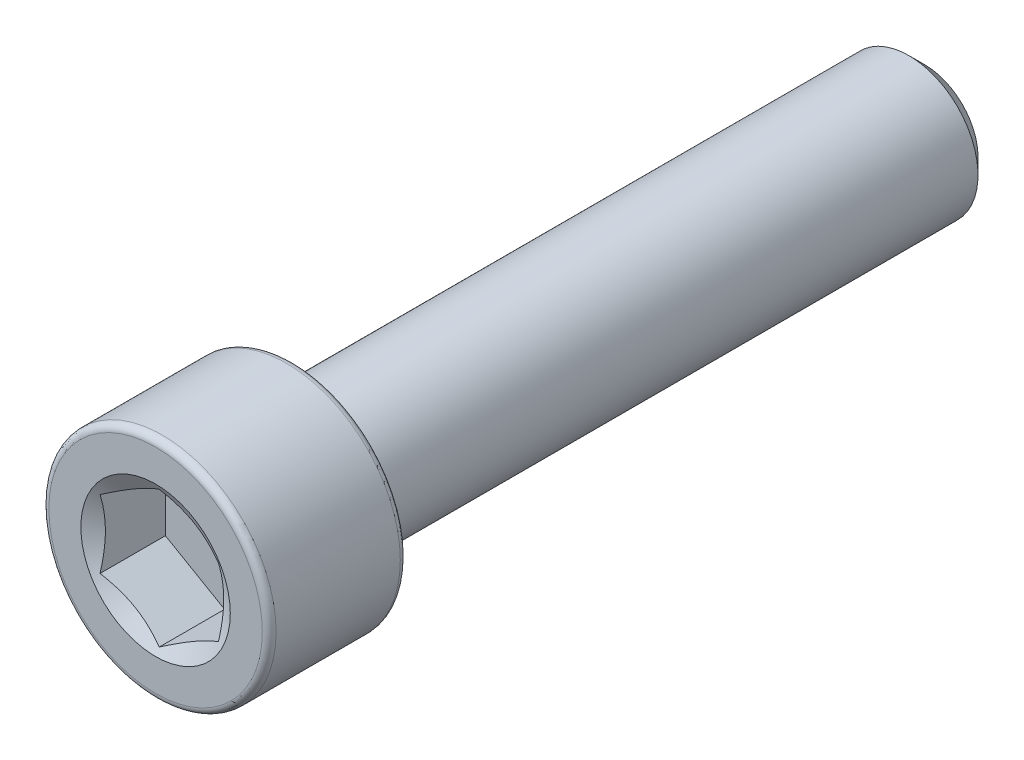
ISO-10303-21;
HEADER;
FILE_DESCRIPTION(('STEP AP214'),'2;1');
FILE_NAME('part.step','',(''),(''),'','','');
FILE_SCHEMA(('AUTOMOTIVE_DESIGN { 1 0 10303 214 1 1 1 1 }'));
ENDSEC;
DATA;
#1=APPLICATION_CONTEXT('core data for automotive mechanical design processes');
#2=APPLICATION_PROTOCOL_DEFINITION('international standard','automotive_design',2000,#1);
#3=PRODUCT_CONTEXT('',#1,'mechanical');
#4=PRODUCT('Part','Part','',(#3));
#5=PRODUCT_RELATED_PRODUCT_CATEGORY('part','',(#4));
#6=PRODUCT_DEFINITION_FORMATION('','',#4);
#7=PRODUCT_DEFINITION_CONTEXT('part definition',#1,'design');
#8=PRODUCT_DEFINITION('design','',#6,#7);
#9=PRODUCT_DEFINITION_SHAPE('','',#8);
#10=(LENGTH_UNIT() NAMED_UNIT(*) SI_UNIT(.MILLI.,.METRE.));
#11=(NAMED_UNIT(*) PLANE_ANGLE_UNIT() SI_UNIT($,.RADIAN.));
#12=(NAMED_UNIT(*) SI_UNIT($,.STERADIAN.) SOLID_ANGLE_UNIT());
#13=UNCERTAINTY_MEASURE_WITH_UNIT(LENGTH_MEASURE(1.E-05),#10,'distance_accuracy_value','');
#14=(GEOMETRIC_REPRESENTATION_CONTEXT(3) GLOBAL_UNCERTAINTY_ASSIGNED_CONTEXT((#13)) GLOBAL_UNIT_ASSIGNED_CONTEXT((#10,
#11,#12)) REPRESENTATION_CONTEXT('',''));
#15=CARTESIAN_POINT('',(0.,0.,0.));
#16=DIRECTION('',(0.,0.,1.));
#17=DIRECTION('',(1.,0.,0.));
#18=AXIS2_PLACEMENT_3D('',#15,#16,#17);
#19=CARTESIAN_POINT('',(0.,0.,-11.6078));
#20=DIRECTION('',(0.,0.,-1.));
#21=DIRECTION('',(-1.,0.,0.));
#22=AXIS2_PLACEMENT_3D('',#19,#20,#21);
#23=PLANE('',#22);
#24=CARTESIAN_POINT('',(0.,0.,-11.6078));
#25=DIRECTION('',(0.,0.,-1.));
#26=DIRECTION('',(-1.,0.,0.));
#27=AXIS2_PLACEMENT_3D('',#24,#25,#26);
#28=CIRCLE('',#27,1.60655000000001);
#29=CARTESIAN_POINT('',(-1.60655000000001,0.,-11.6078));
#30=VERTEX_POINT('',#29);
#31=EDGE_CURVE('E57',#30,#30,#28,.T.);
#32=ORIENTED_EDGE('',*,*,#31,.T.);
#33=EDGE_LOOP('',(#32));
#34=FACE_BOUND('',#33,.T.);
#35=ADVANCED_FACE('F43',(#34),#23,.T.);
#36=CARTESIAN_POINT('',(0.,0.,-11.6078));
#37=DIRECTION('',(0.,0.,1.));
#38=DIRECTION('',(1.,0.,0.));
#39=AXIS2_PLACEMENT_3D('',#36,#37,#38);
#40=CONICAL_SURFACE('',#39,1.60655000000001,0.785398163397449);
#41=CARTESIAN_POINT('',(0.,0.,-11.13155));
#42=DIRECTION('',(0.,0.,-1.));
#43=DIRECTION('',(-1.,0.,0.));
#44=AXIS2_PLACEMENT_3D('',#41,#42,#43);
#45=CIRCLE('',#44,2.08280000000001);
#46=CARTESIAN_POINT('',(-2.08280000000001,0.,-11.13155));
#47=VERTEX_POINT('',#46);
#48=EDGE_CURVE('E151',#47,#47,#45,.T.);
#49=ORIENTED_EDGE('',*,*,#48,.T.);
#50=EDGE_LOOP('',(#49));
#51=FACE_BOUND('',#50,.T.);
#52=ORIENTED_EDGE('',*,*,#31,.F.);
#53=EDGE_LOOP('',(#52));
#54=FACE_BOUND('',#53,.T.);
#55=ADVANCED_FACE('F159',(#51,#54),#40,.T.);
#56=CARTESIAN_POINT('',(0.,0.,-11.6078));
#57=DIRECTION('',(0.,0.,-1.));
#58=DIRECTION('',(-1.,0.,0.));
#59=AXIS2_PLACEMENT_3D('',#56,#57,#58);
#60=CYLINDRICAL_SURFACE('',#59,2.08280000000001);
#61=CARTESIAN_POINT('',(0.,0.,7.44220000000001));
#62=DIRECTION('',(0.,0.,-1.));
#63=DIRECTION('',(-1.,0.,0.));
#64=AXIS2_PLACEMENT_3D('',#61,#62,#63);
#65=CIRCLE('',#64,2.08280000000001);
#66=CARTESIAN_POINT('',(-2.08280000000001,0.,7.44220000000001));
#67=VERTEX_POINT('',#66);
#68=EDGE_CURVE('E147',#67,#67,#65,.T.);
#69=ORIENTED_EDGE('',*,*,#68,.T.);
#70=EDGE_LOOP('',(#69));
#71=FACE_BOUND('',#70,.T.);
#72=ORIENTED_EDGE('',*,*,#48,.F.);
#73=EDGE_LOOP('',(#72));
#74=FACE_BOUND('',#73,.T.);
#75=ADVANCED_FACE('F161',(#71,#74),#60,.T.);
#76=CARTESIAN_POINT('',(0.,2.0828,7.4422));
#77=DIRECTION('',(0.,0.,-1.));
#78=DIRECTION('',(-1.,0.,0.));
#79=AXIS2_PLACEMENT_3D('',#76,#77,#78);
#80=PLANE('',#79);
#81=CARTESIAN_POINT('',(0.,0.,7.44220000000001));
#82=DIRECTION('',(0.,0.,-1.));
#83=DIRECTION('',(-1.,0.,0.));
#84=AXIS2_PLACEMENT_3D('',#81,#82,#83);
#85=CIRCLE('',#84,3.22072);
#86=CARTESIAN_POINT('',(-3.22072,0.,7.44220000000001));
#87=VERTEX_POINT('',#86);
#88=EDGE_CURVE('E143',#87,#87,#85,.T.);
#89=ORIENTED_EDGE('',*,*,#88,.T.);
#90=EDGE_LOOP('',(#89));
#91=FACE_BOUND('',#90,.T.);
#92=ORIENTED_EDGE('',*,*,#68,.F.);
#93=EDGE_LOOP('',(#92));
#94=FACE_BOUND('',#93,.T.);
#95=ADVANCED_FACE('F168',(#91,#94),#80,.T.);
#96=CARTESIAN_POINT('',(0.,0.,7.65048));
#97=DIRECTION('',(0.,0.,-1.));
#98=DIRECTION('',(-1.,0.,0.));
#99=AXIS2_PLACEMENT_3D('',#96,#97,#98);
#100=TOROIDAL_SURFACE('',#99,3.22072,0.20828);
#101=CARTESIAN_POINT('',(0.,0.,7.65048000000001));
#102=DIRECTION('',(0.,0.,-1.));
#103=DIRECTION('',(-1.,0.,0.));
#104=AXIS2_PLACEMENT_3D('',#101,#102,#103);
#105=CIRCLE('',#104,3.429);
#106=CARTESIAN_POINT('',(-3.429,0.,7.65048000000001));
#107=VERTEX_POINT('',#106);
#108=EDGE_CURVE('E139',#107,#107,#105,.T.);
#109=ORIENTED_EDGE('',*,*,#108,.T.);
#110=EDGE_LOOP('',(#109));
#111=FACE_BOUND('',#110,.T.);
#112=ORIENTED_EDGE('',*,*,#88,.F.);
#113=EDGE_LOOP('',(#112));
#114=FACE_BOUND('',#113,.T.);
#115=ADVANCED_FACE('F174',(#111,#114),#100,.T.);
#116=CARTESIAN_POINT('',(0.,0.,-11.6078));
#117=DIRECTION('',(0.,0.,-1.));
#118=DIRECTION('',(-1.,0.,0.));
#119=AXIS2_PLACEMENT_3D('',#116,#117,#118);
#120=CYLINDRICAL_SURFACE('',#119,3.429);
#121=CARTESIAN_POINT('',(0.,0.,11.39952));
#122=DIRECTION('',(0.,0.,-1.));
#123=DIRECTION('',(-1.,0.,0.));
#124=AXIS2_PLACEMENT_3D('',#121,#122,#123);
#125=CIRCLE('',#124,3.429);
#126=CARTESIAN_POINT('',(-3.429,0.,11.39952));
#127=VERTEX_POINT('',#126);
#128=EDGE_CURVE('E135',#127,#127,#125,.T.);
#129=ORIENTED_EDGE('',*,*,#128,.T.);
#130=EDGE_LOOP('',(#129));
#131=FACE_BOUND('',#130,.T.);
#132=ORIENTED_EDGE('',*,*,#108,.F.);
#133=EDGE_LOOP('',(#132));
#134=FACE_BOUND('',#133,.T.);
#135=ADVANCED_FACE('F178',(#131,#134),#120,.T.);
#136=CARTESIAN_POINT('',(0.,0.,11.39952));
#137=DIRECTION('',(0.,0.,-1.));
#138=DIRECTION('',(-1.,0.,0.));
#139=AXIS2_PLACEMENT_3D('',#136,#137,#138);
#140=TOROIDAL_SURFACE('',#139,3.22072,0.208280000000001);
#141=CARTESIAN_POINT('',(0.,0.,11.6078));
#142=DIRECTION('',(0.,0.,-1.));
#143=DIRECTION('',(-1.,0.,0.));
#144=AXIS2_PLACEMENT_3D('',#141,#142,#143);
#145=CIRCLE('',#144,3.22072);
#146=CARTESIAN_POINT('',(-3.22072,0.,11.6078));
#147=VERTEX_POINT('',#146);
#148=EDGE_CURVE('E131',#147,#147,#145,.T.);
#149=ORIENTED_EDGE('',*,*,#148,.T.);
#150=EDGE_LOOP('',(#149));
#151=FACE_BOUND('',#150,.T.);
#152=ORIENTED_EDGE('',*,*,#128,.F.);
#153=EDGE_LOOP('',(#152));
#154=FACE_BOUND('',#153,.T.);
#155=ADVANCED_FACE('F182',(#151,#154),#140,.T.);
#156=CARTESIAN_POINT('',(0.,3.22072,11.6078));
#157=DIRECTION('',(0.,0.,1.));
#158=DIRECTION('',(1.,0.,0.));
#159=AXIS2_PLACEMENT_3D('',#156,#157,#158);
#160=PLANE('',#159);
#161=CARTESIAN_POINT('',(0.,0.,11.6078));
#162=DIRECTION('',(0.,0.,1.));
#163=DIRECTION('',(1.,0.,0.));
#164=AXIS2_PLACEMENT_3D('',#161,#162,#163);
#165=CIRCLE('',#164,2.25530582730141);
#166=CARTESIAN_POINT('',(2.25530582730141,0.,11.6078));
#167=VERTEX_POINT('',#166);
#168=EDGE_CURVE('E290',#167,#167,#165,.T.);
#169=ORIENTED_EDGE('',*,*,#168,.F.);
#170=EDGE_LOOP('',(#169));
#171=FACE_BOUND('',#170,.T.);
#172=ORIENTED_EDGE('',*,*,#148,.F.);
#173=EDGE_LOOP('',(#172));
#174=FACE_BOUND('',#173,.T.);
#175=ADVANCED_FACE('F186',(#171,#174),#160,.T.);
#176=CARTESIAN_POINT('',(0.,0.,11.6078));
#177=DIRECTION('',(0.,0.,1.));
#178=DIRECTION('',(1.,0.,0.));
#179=AXIS2_PLACEMENT_3D('',#176,#177,#178);
#180=CONICAL_SURFACE('',#179,2.25530582730141,1.0471975511966);
#181=ORIENTED_EDGE('',*,*,#168,.T.);
#182=EDGE_LOOP('',(#181));
#183=FACE_BOUND('',#182,.T.);
#184=CARTESIAN_POINT('',(1.7861375,1.03099602632701,11.4963902457683));
#185=CARTESIAN_POINT('',(1.70765298753214,1.07630908072754,11.4702168076921));
#186=CARTESIAN_POINT('',(1.62849100532972,1.12201327246169,11.4464125992998));
#187=CARTESIAN_POINT('',(1.46879612904912,1.2142131522705,11.4048611490479));
#188=CARTESIAN_POINT('',(1.38826039638754,1.26071047920205,11.3871286082323));
#189=CARTESIAN_POINT('',(1.22818707140352,1.35312885647165,11.3595240038494));
#190=CARTESIAN_POINT('',(1.14867411525882,1.39903568310585,11.349468239448));
#191=CARTESIAN_POINT('',(0.989273866724132,1.49106545950625,11.3374614604738));
#192=CARTESIAN_POINT('',(0.909387154117849,1.53718807453416,11.3355005056729));
#193=CARTESIAN_POINT('',(0.76010104079842,1.62337845224541,11.3395693606205));
#194=CARTESIAN_POINT('',(0.690679347730419,1.66345908542582,11.3446001252606));
#195=CARTESIAN_POINT('',(0.552288266102525,1.74335921365712,11.3605479939992));
#196=CARTESIAN_POINT('',(0.483319356586403,1.78317843213197,11.3714705514371));
#197=CARTESIAN_POINT('',(0.34464269577066,1.86324343958426,11.3987773973743));
#198=CARTESIAN_POINT('',(0.274952505639711,1.90347908961624,11.4152774949854));
#199=CARTESIAN_POINT('',(0.13661183024592,1.98335011579472,11.4527267258336));
#200=CARTESIAN_POINT('',(0.0679595711845169,2.0229865160443,11.4736670537832));
#201=CARTESIAN_POINT('',(-0.00020000000000081,2.06233846281553,11.4963902457683));
#202=B_SPLINE_CURVE_WITH_KNOTS('',3,(#184,#185,#186,#187,#188,#189,#190,#191,#192,#193,#194,
#195,#196,#197,#198,#199,#200,#201),.UNSPECIFIED.,.F.,.F.,(4,2,2,2,2,2,2,2,4),(0.,
0.283101204842066,0.566883100888334,0.84364073208294,1.12005841039329,1.3607861247116,
1.60173703564045,1.84803423693754,2.09384750668611),.UNSPECIFIED.);
#203=CARTESIAN_POINT('',(1.7859375,1.03111149638084,11.4963235735026));
#204=VERTEX_POINT('',#203);
#205=CARTESIAN_POINT('',(0.,2.06222299276169,11.4963235735026));
#206=VERTEX_POINT('',#205);
#207=EDGE_CURVE('E112',#204,#206,#202,.T.);
#208=ORIENTED_EDGE('',*,*,#207,.F.);
#209=CARTESIAN_POINT('',(1.7859375,-2.69758264771829,12.1735426868391));
#210=CARTESIAN_POINT('',(1.7859375,-2.62012259041519,12.1362636843077));
#211=CARTESIAN_POINT('',(1.7859375,-2.54247668483849,12.0993637946794));
#212=CARTESIAN_POINT('',(1.7859375,-2.38671397459031,12.0265371845213));
#213=CARTESIAN_POINT('',(1.7859375,-2.30859709065796,11.9906106337188));
#214=CARTESIAN_POINT('',(1.7859375,-2.15135521009003,11.9197492558914));
#215=CARTESIAN_POINT('',(1.7859375,-2.0722269823703,11.8848215722438));
#216=CARTESIAN_POINT('',(1.7859375,-1.9133149359869,11.8164965769099));
#217=CARTESIAN_POINT('',(1.7859375,-1.83353115094795,11.7830991873029));
#218=CARTESIAN_POINT('',(1.7859375,-1.67096618357135,11.7173456687277));
#219=CARTESIAN_POINT('',(1.7859375,-1.58816300038914,11.6850436191632));
#220=CARTESIAN_POINT('',(1.7859375,-1.42156112656087,11.6230632721621));
#221=CARTESIAN_POINT('',(1.7859375,-1.33776231333349,11.5933853016785));
#222=CARTESIAN_POINT('',(1.7859375,-1.1692220220391,11.5374867539738));
#223=CARTESIAN_POINT('',(1.7859375,-1.084483165363,11.5112583568392));
#224=CARTESIAN_POINT('',(1.7859375,-0.913786163547338,11.4631433270575));
#225=CARTESIAN_POINT('',(1.7859375,-0.827828324781464,11.4412556234588));
#226=CARTESIAN_POINT('',(1.7859375,-0.65508454988443,11.4030261588678));
#227=CARTESIAN_POINT('',(1.7859375,-0.568304335338395,11.3866590421217));
#228=CARTESIAN_POINT('',(1.7859375,-0.393746048068966,11.3604528135952));
#229=CARTESIAN_POINT('',(1.7859375,-0.305968052538008,11.3506132002697));
#230=CARTESIAN_POINT('',(1.7859375,-0.130962716485577,11.3383785557359));
#231=CARTESIAN_POINT('',(1.7859375,-0.0437418469765708,11.3358936055758));
#232=CARTESIAN_POINT('',(1.7859375,0.130592934900126,11.3383360702321));
#233=CARTESIAN_POINT('',(1.7859375,0.217706841000561,11.343263900411));
#234=CARTESIAN_POINT('',(1.7859375,0.431120733446832,11.3639821974728));
#235=CARTESIAN_POINT('',(1.7859375,0.557038517233458,11.3837228004352));
#236=CARTESIAN_POINT('',(1.7859375,0.806440222774732,11.4350381632509));
#237=CARTESIAN_POINT('',(1.7859375,0.929921492877506,11.4666251403236));
#238=CARTESIAN_POINT('',(1.7859375,1.17712757795221,11.5390666470736));
#239=CARTESIAN_POINT('',(1.7859375,1.30079401125151,11.5801156843391));
#240=CARTESIAN_POINT('',(1.7859375,1.48458504652945,11.6462570287602));
#241=CARTESIAN_POINT('',(1.7859375,1.54555601200979,11.6690621265715));
#242=CARTESIAN_POINT('',(1.7859375,1.66700448583619,11.7159509496154));
#243=CARTESIAN_POINT('',(1.7859375,1.72748200297302,11.7400346520121));
#244=CARTESIAN_POINT('',(1.7859375,1.88424149051046,11.8040616553898));
#245=CARTESIAN_POINT('',(1.7859375,1.98018443802618,11.8448329191166));
#246=CARTESIAN_POINT('',(1.7859375,2.17117609670513,11.9284247196407));
#247=CARTESIAN_POINT('',(1.7859375,2.26622473668082,11.9712454179505));
#248=CARTESIAN_POINT('',(1.7859375,2.55034675834729,12.1020525004115));
#249=CARTESIAN_POINT('',(1.7859375,2.73834755541705,12.1923633596409));
#250=CARTESIAN_POINT('',(1.7859375,3.11271398702263,12.3768619991649));
#251=CARTESIAN_POINT('',(1.7859375,3.29907721105926,12.4710546102587));
#252=CARTESIAN_POINT('',(1.7859375,3.67050227471047,12.6618957072539));
#253=CARTESIAN_POINT('',(1.7859375,3.85556431392614,12.7585438055063));
#254=CARTESIAN_POINT('',(1.7859375,4.20682233829505,12.94403234663));
#255=CARTESIAN_POINT('',(1.7859375,4.37310096820638,13.032716846137));
#256=CARTESIAN_POINT('',(1.7859375,4.70512305489092,13.2110996279772));
#257=CARTESIAN_POINT('',(1.7859375,4.87086648642208,13.3007979572539));
#258=CARTESIAN_POINT('',(1.7859375,5.20149434658741,13.4807084214208));
#259=CARTESIAN_POINT('',(1.7859375,5.36637988633188,13.5709185171521));
#260=CARTESIAN_POINT('',(1.7859375,5.69581647813698,13.7519235664943));
#261=CARTESIAN_POINT('',(1.7859375,5.86036755026335,13.8427184835707));
#262=CARTESIAN_POINT('',(1.7859375,6.02479942172329,13.9337274610164));
#263=B_SPLINE_CURVE_WITH_KNOTS('',3,(#209,#210,#211,#212,#213,#214,#215,#216,#217,#218,#219,
#220,#221,#222,#223,#224,#225,#226,#227,#228,#229,#230,#231,#232,#233,#234,#235,#236,#237,#238,
#239,#240,#241,#242,#243,#244,#245,#246,#247,#248,#249,#250,#251,#252,#253,#254,#255,#256,#257,
#258,#259,#260,#261,#262),.UNSPECIFIED.,.F.,.F.,(4,2,2,2,2,2,2,2,2,2,2,2,2,2,2,2,2,2,2,2,2,2,2,
2,2,2,4),(0.,0.257895100869513,0.515834886822403,0.775304092310055,1.03476007121658,
1.30136802092372,1.56800914256978,1.83403498977159,2.09999512023697,2.36471652541159,
2.62941758818124,2.89086873629834,3.1523345349342,3.53391158235073,3.91588323889408,
4.30654567753014,4.50182529543227,4.69710142679918,5.00980707595598,5.32253740962821,
5.94815647890532,6.57457913899204,7.20090351250653,7.7662505201844,8.33162381337452,
8.8954717413773,9.45928478023969),.UNSPECIFIED.);
#264=CARTESIAN_POINT('',(1.7859375,-1.03111149638084,11.4963235735026));
#265=VERTEX_POINT('',#264);
#266=EDGE_CURVE('E232',#265,#204,#263,.T.);
#267=ORIENTED_EDGE('',*,*,#266,.F.);
#268=CARTESIAN_POINT('',(-0.000200000000001353,-2.06233846281553,11.4963902457683));
#269=CARTESIAN_POINT('',(0.0782845124678569,-2.017025408415,11.4702168076921));
#270=CARTESIAN_POINT('',(0.157446494670274,-1.97132121668084,11.4464125992998));
#271=CARTESIAN_POINT('',(0.317141370950877,-1.87912133687203,11.4048611490479));
#272=CARTESIAN_POINT('',(0.397677103612454,-1.83262400994049,11.3871286082323));
#273=CARTESIAN_POINT('',(0.557750428596472,-1.74020563267089,11.3595240038494));
#274=CARTESIAN_POINT('',(0.63726338474117,-1.69429880603668,11.349468239448));
#275=CARTESIAN_POINT('',(0.796663633275862,-1.60226902963629,11.3374614604738));
#276=CARTESIAN_POINT('',(0.876550345882144,-1.55614641460837,11.3355005056729));
#277=CARTESIAN_POINT('',(1.02583645920157,-1.46995603689713,11.3395693606205));
#278=CARTESIAN_POINT('',(1.09525815226958,-1.42987540371672,11.3446001252606));
#279=CARTESIAN_POINT('',(1.23364923389747,-1.34997527548541,11.3605479939992));
#280=CARTESIAN_POINT('',(1.30261814341359,-1.31015605701056,11.3714705514371));
#281=CARTESIAN_POINT('',(1.44129480422933,-1.23009104955827,11.3987773973743));
#282=CARTESIAN_POINT('',(1.51098499436028,-1.18985539952629,11.4152774949854));
#283=CARTESIAN_POINT('',(1.64932566975408,-1.10998437334781,11.4527267258336));
#284=CARTESIAN_POINT('',(1.71797792881548,-1.07034797309824,11.4736670537832));
#285=CARTESIAN_POINT('',(1.7861375,-1.03099602632701,11.4963902457683));
#286=B_SPLINE_CURVE_WITH_KNOTS('',3,(#268,#269,#270,#271,#272,#273,#274,#275,#276,#277,#278,
#279,#280,#281,#282,#283,#284,#285),.UNSPECIFIED.,.F.,.F.,(4,2,2,2,2,2,2,2,4),(0.,
0.283101204842065,0.566883100888333,0.84364073208294,1.12005841039329,1.3607861247116,
1.60173703564045,1.84803423693754,2.09384750668611),.UNSPECIFIED.);
#287=CARTESIAN_POINT('',(0.,-2.06222299276169,11.4963235735026));
#288=VERTEX_POINT('',#287);
#289=EDGE_CURVE('E226',#288,#265,#286,.T.);
#290=ORIENTED_EDGE('',*,*,#289,.F.);
#291=CARTESIAN_POINT('',(-1.7861375,-1.03099602632701,11.4963902457683));
#292=CARTESIAN_POINT('',(-1.70765298753214,-1.07630908072754,11.4702168076921));
#293=CARTESIAN_POINT('',(-1.62849100532972,-1.12201327246169,11.4464125992998));
#294=CARTESIAN_POINT('',(-1.46879612904912,-1.2142131522705,11.4048611490479));
#295=CARTESIAN_POINT('',(-1.38826039638754,-1.26071047920205,11.3871286082323));
#296=CARTESIAN_POINT('',(-1.22818707140352,-1.35312885647165,11.3595240038494));
#297=CARTESIAN_POINT('',(-1.14867411525882,-1.39903568310585,11.349468239448));
#298=CARTESIAN_POINT('',(-0.989273866724133,-1.49106545950625,11.3374614604738));
#299=CARTESIAN_POINT('',(-0.90938715411785,-1.53718807453416,11.3355005056729));
#300=CARTESIAN_POINT('',(-0.760101040798421,-1.62337845224541,11.3395693606205));
#301=CARTESIAN_POINT('',(-0.69067934773042,-1.66345908542582,11.3446001252606));
#302=CARTESIAN_POINT('',(-0.552288266102526,-1.74335921365713,11.3605479939992));
#303=CARTESIAN_POINT('',(-0.483319356586404,-1.78317843213197,11.3714705514371));
#304=CARTESIAN_POINT('',(-0.344642695770662,-1.86324343958426,11.3987773973743));
#305=CARTESIAN_POINT('',(-0.274952505639713,-1.90347908961624,11.4152774949854));
#306=CARTESIAN_POINT('',(-0.136611830245922,-1.98335011579472,11.4527267258336));
#307=CARTESIAN_POINT('',(-0.0679595711845194,-2.0229865160443,11.4736670537832));
#308=CARTESIAN_POINT('',(0.000199999999998694,-2.06233846281553,11.4963902457683));
#309=B_SPLINE_CURVE_WITH_KNOTS('',3,(#291,#292,#293,#294,#295,#296,#297,#298,#299,#300,#301,
#302,#303,#304,#305,#306,#307,#308),.UNSPECIFIED.,.F.,.F.,(4,2,2,2,2,2,2,2,4),(0.,
0.283101204842065,0.566883100888334,0.84364073208294,1.12005841039329,1.3607861247116,
1.60173703564045,1.84803423693754,2.0938475066861),.UNSPECIFIED.);
#310=CARTESIAN_POINT('',(-1.7859375,-1.03111149638085,11.4963235735026));
#311=VERTEX_POINT('',#310);
#312=EDGE_CURVE('E64',#311,#288,#309,.T.);
#313=ORIENTED_EDGE('',*,*,#312,.F.);
#314=CARTESIAN_POINT('',(-1.7859375,-2.6975826477183,12.1735426868391));
#315=CARTESIAN_POINT('',(-1.7859375,-2.6201225904152,12.1362636843077));
#316=CARTESIAN_POINT('',(-1.7859375,-2.5424766848385,12.0993637946794));
#317=CARTESIAN_POINT('',(-1.7859375,-2.38671397459032,12.0265371845213));
#318=CARTESIAN_POINT('',(-1.7859375,-2.30859709065797,11.9906106337188));
#319=CARTESIAN_POINT('',(-1.7859375,-2.15135521009004,11.9197492558914));
#320=CARTESIAN_POINT('',(-1.7859375,-2.0722269823703,11.8848215722438));
#321=CARTESIAN_POINT('',(-1.7859375,-1.9133149359869,11.8164965769099));
#322=CARTESIAN_POINT('',(-1.7859375,-1.83353115094795,11.7830991873029));
#323=CARTESIAN_POINT('',(-1.7859375,-1.67096618357136,11.7173456687277));
#324=CARTESIAN_POINT('',(-1.7859375,-1.58816300038914,11.6850436191632));
#325=CARTESIAN_POINT('',(-1.7859375,-1.42156112656088,11.6230632721621));
#326=CARTESIAN_POINT('',(-1.7859375,-1.33776231333349,11.5933853016785));
#327=CARTESIAN_POINT('',(-1.7859375,-1.16922202203911,11.5374867539738));
#328=CARTESIAN_POINT('',(-1.7859375,-1.084483165363,11.5112583568392));
#329=CARTESIAN_POINT('',(-1.7859375,-0.913786163547341,11.4631433270575));
#330=CARTESIAN_POINT('',(-1.7859375,-0.827828324781467,11.4412556234588));
#331=CARTESIAN_POINT('',(-1.7859375,-0.655084549884432,11.4030261588678));
#332=CARTESIAN_POINT('',(-1.7859375,-0.568304335338397,11.3866590421217));
#333=CARTESIAN_POINT('',(-1.7859375,-0.393746048068968,11.3604528135952));
#334=CARTESIAN_POINT('',(-1.7859375,-0.30596805253801,11.3506132002697));
#335=CARTESIAN_POINT('',(-1.7859375,-0.130962716485578,11.3383785557359));
#336=CARTESIAN_POINT('',(-1.7859375,-0.0437418469765714,11.3358936055758));
#337=CARTESIAN_POINT('',(-1.7859375,0.130592934900126,11.3383360702321));
#338=CARTESIAN_POINT('',(-1.7859375,0.217706841000561,11.343263900411));
#339=CARTESIAN_POINT('',(-1.7859375,0.431120733446832,11.3639821974728));
#340=CARTESIAN_POINT('',(-1.7859375,0.557038517233458,11.3837228004352));
#341=CARTESIAN_POINT('',(-1.7859375,0.806440222774732,11.4350381632509));
#342=CARTESIAN_POINT('',(-1.7859375,0.929921492877505,11.4666251403236));
#343=CARTESIAN_POINT('',(-1.7859375,1.17712757795221,11.5390666470736));
#344=CARTESIAN_POINT('',(-1.7859375,1.30079401125151,11.5801156843391));
#345=CARTESIAN_POINT('',(-1.7859375,1.48458504652945,11.6462570287602));
#346=CARTESIAN_POINT('',(-1.7859375,1.54555601200979,11.6690621265715));
#347=CARTESIAN_POINT('',(-1.7859375,1.66700448583619,11.7159509496154));
#348=CARTESIAN_POINT('',(-1.7859375,1.72748200297302,11.7400346520121));
#349=CARTESIAN_POINT('',(-1.7859375,1.88424149051046,11.8040616553898));
#350=CARTESIAN_POINT('',(-1.7859375,1.98018443802618,11.8448329191166));
#351=CARTESIAN_POINT('',(-1.7859375,2.17117609670512,11.9284247196407));
#352=CARTESIAN_POINT('',(-1.7859375,2.26622473668082,11.9712454179505));
#353=CARTESIAN_POINT('',(-1.7859375,2.55034675834729,12.1020525004115));
#354=CARTESIAN_POINT('',(-1.7859375,2.73834755541705,12.1923633596409));
#355=CARTESIAN_POINT('',(-1.7859375,3.11271398702262,12.3768619991649));
#356=CARTESIAN_POINT('',(-1.78593749999999,3.29907721105926,12.4710546102587));
#357=CARTESIAN_POINT('',(-1.78593749999999,3.67050227471047,12.6618957072539));
#358=CARTESIAN_POINT('',(-1.78593749999999,3.85556431392614,12.7585438055063));
#359=CARTESIAN_POINT('',(-1.78593749999999,4.20682233829505,12.94403234663));
#360=CARTESIAN_POINT('',(-1.78593749999999,4.37310096820637,13.032716846137));
#361=CARTESIAN_POINT('',(-1.78593749999999,4.70512305489092,13.2110996279772));
#362=CARTESIAN_POINT('',(-1.78593749999999,4.87086648642208,13.3007979572539));
#363=CARTESIAN_POINT('',(-1.78593749999999,5.20149434658741,13.4807084214208));
#364=CARTESIAN_POINT('',(-1.78593749999999,5.36637988633188,13.5709185171521));
#365=CARTESIAN_POINT('',(-1.78593749999999,5.69581647813698,13.7519235664943));
#366=CARTESIAN_POINT('',(-1.78593749999999,5.86036755026335,13.8427184835707));
#367=CARTESIAN_POINT('',(-1.78593749999999,6.02479942172329,13.9337274610164));
#368=B_SPLINE_CURVE_WITH_KNOTS('',3,(#314,#315,#316,#317,#318,#319,#320,#321,#322,#323,#324,
#325,#326,#327,#328,#329,#330,#331,#332,#333,#334,#335,#336,#337,#338,#339,#340,#341,#342,#343,
#344,#345,#346,#347,#348,#349,#350,#351,#352,#353,#354,#355,#356,#357,#358,#359,#360,#361,#362,
#363,#364,#365,#366,#367),.UNSPECIFIED.,.F.,.F.,(4,2,2,2,2,2,2,2,2,2,2,2,2,2,2,2,2,2,2,2,2,2,2,
2,2,2,4),(0.,0.257895100869512,0.515834886822403,0.775304092310056,1.03476007121658,
1.30136802092372,1.56800914256978,1.83403498977159,2.09999512023697,2.3647165254116,
2.62941758818124,2.89086873629835,3.1523345349342,3.53391158235073,3.91588323889409,
4.30654567753014,4.50182529543227,4.69710142679919,5.00980707595598,5.32253740962821,
5.94815647890532,6.57457913899204,7.20090351250653,7.7662505201844,8.33162381337452,
8.8954717413773,9.4592847802397),.UNSPECIFIED.);
#369=CARTESIAN_POINT('',(-1.7859375,1.03111149638085,11.4963235735026));
#370=VERTEX_POINT('',#369);
#371=EDGE_CURVE('E11',#370,#311,#368,.F.);
#372=ORIENTED_EDGE('',*,*,#371,.F.);
#373=CARTESIAN_POINT('',(0.000199999999998865,2.06233846281553,11.4963902457683));
#374=CARTESIAN_POINT('',(-0.0782845124678595,2.01702540841499,11.4702168076921));
#375=CARTESIAN_POINT('',(-0.157446494670277,1.97132121668084,11.4464125992998));
#376=CARTESIAN_POINT('',(-0.317141370950879,1.87912133687203,11.4048611490479));
#377=CARTESIAN_POINT('',(-0.397677103612457,1.83262400994049,11.3871286082323));
#378=CARTESIAN_POINT('',(-0.557750428596474,1.74020563267089,11.3595240038494));
#379=CARTESIAN_POINT('',(-0.637263384741173,1.69429880603668,11.349468239448));
#380=CARTESIAN_POINT('',(-0.796663633275864,1.60226902963628,11.3374614604738));
#381=CARTESIAN_POINT('',(-0.876550345882147,1.55614641460837,11.3355005056729));
#382=CARTESIAN_POINT('',(-1.02583645920158,1.46995603689713,11.3395693606205));
#383=CARTESIAN_POINT('',(-1.09525815226958,1.42987540371672,11.3446001252606));
#384=CARTESIAN_POINT('',(-1.23364923389747,1.34997527548541,11.3605479939992));
#385=CARTESIAN_POINT('',(-1.30261814341359,1.31015605701056,11.3714705514371));
#386=CARTESIAN_POINT('',(-1.44129480422934,1.23009104955827,11.3987773973743));
#387=CARTESIAN_POINT('',(-1.51098499436028,1.18985539952629,11.4152774949854));
#388=CARTESIAN_POINT('',(-1.64932566975408,1.10998437334781,11.4527267258336));
#389=CARTESIAN_POINT('',(-1.71797792881548,1.07034797309824,11.4736670537832));
#390=CARTESIAN_POINT('',(-1.7861375,1.03099602632701,11.4963902457683));
#391=B_SPLINE_CURVE_WITH_KNOTS('',3,(#373,#374,#375,#376,#377,#378,#379,#380,#381,#382,#383,
#384,#385,#386,#387,#388,#389,#390),.UNSPECIFIED.,.F.,.F.,(4,2,2,2,2,2,2,2,4),(0.,
0.283101204842065,0.566883100888333,0.84364073208294,1.12005841039329,1.3607861247116,
1.60173703564045,1.84803423693754,2.0938475066861),.UNSPECIFIED.);
#392=EDGE_CURVE('E102',#206,#370,#391,.T.);
#393=ORIENTED_EDGE('',*,*,#392,.F.);
#394=EDGE_LOOP('',(#208,#267,#290,#313,#372,#393));
#395=FACE_BOUND('',#394,.T.);
#396=ADVANCED_FACE('F101',(#183,#395),#180,.F.);
#397=CARTESIAN_POINT('',(0.,0.,9.525));
#398=DIRECTION('',(0.,0.,1.));
#399=DIRECTION('',(1.,0.,0.));
#400=AXIS2_PLACEMENT_3D('',#397,#398,#399);
#401=PLANE('',#400);
#402=DIRECTION('',(-0.866025403784438,-0.5,0.));
#403=VECTOR('',#402,1.);
#404=CARTESIAN_POINT('',(0.,2.06222299276169,9.525));
#405=LINE('',#404,#403);
#406=CARTESIAN_POINT('',(0.,2.06222299276169,9.525));
#407=VERTEX_POINT('',#406);
#408=CARTESIAN_POINT('',(-1.7859375,1.03111149638085,9.525));
#409=VERTEX_POINT('',#408);
#410=EDGE_CURVE('E111',#407,#409,#405,.T.);
#411=ORIENTED_EDGE('',*,*,#410,.T.);
#412=DIRECTION('',(0.,-1.,0.));
#413=VECTOR('',#412,1.);
#414=CARTESIAN_POINT('',(-1.7859375,1.03111149638085,9.525));
#415=LINE('',#414,#413);
#416=CARTESIAN_POINT('',(-1.7859375,-1.03111149638085,9.525));
#417=VERTEX_POINT('',#416);
#418=EDGE_CURVE('E116',#409,#417,#415,.T.);
#419=ORIENTED_EDGE('',*,*,#418,.T.);
#420=DIRECTION('',(0.866025403784439,-0.5,0.));
#421=VECTOR('',#420,1.);
#422=CARTESIAN_POINT('',(-1.7859375,-1.03111149638085,9.525));
#423=LINE('',#422,#421);
#424=CARTESIAN_POINT('',(0.,-2.06222299276169,9.525));
#425=VERTEX_POINT('',#424);
#426=EDGE_CURVE('E259',#417,#425,#423,.T.);
#427=ORIENTED_EDGE('',*,*,#426,.T.);
#428=DIRECTION('',(0.866025403784438,0.5,0.));
#429=VECTOR('',#428,1.);
#430=CARTESIAN_POINT('',(0.,-2.06222299276169,9.525));
#431=LINE('',#430,#429);
#432=CARTESIAN_POINT('',(1.7859375,-1.03111149638084,9.525));
#433=VERTEX_POINT('',#432);
#434=EDGE_CURVE('E264',#425,#433,#431,.T.);
#435=ORIENTED_EDGE('',*,*,#434,.T.);
#436=DIRECTION('',(0.,1.,0.));
#437=VECTOR('',#436,1.);
#438=CARTESIAN_POINT('',(1.7859375,-1.03111149638084,9.525));
#439=LINE('',#438,#437);
#440=CARTESIAN_POINT('',(1.7859375,1.03111149638084,9.525));
#441=VERTEX_POINT('',#440);
#442=EDGE_CURVE('E127',#433,#441,#439,.T.);
#443=ORIENTED_EDGE('',*,*,#442,.T.);
#444=DIRECTION('',(-0.866025403784439,0.5,0.));
#445=VECTOR('',#444,1.);
#446=CARTESIAN_POINT('',(1.7859375,1.03111149638084,9.525));
#447=LINE('',#446,#445);
#448=EDGE_CURVE('E120',#441,#407,#447,.T.);
#449=ORIENTED_EDGE('',*,*,#448,.T.);
#450=EDGE_LOOP('',(#411,#419,#427,#435,#443,#449));
#451=FACE_BOUND('',#450,.T.);
#452=ADVANCED_FACE('F212',(#451),#401,.T.);
#453=CARTESIAN_POINT('',(-1.7859375,1.03111149638085,9.525));
#454=DIRECTION('',(-1.,0.,0.));
#455=DIRECTION('',(0.,-1.,0.));
#456=AXIS2_PLACEMENT_3D('',#453,#454,#455);
#457=PLANE('',#456);
#458=DIRECTION('',(0.,0.,1.));
#459=VECTOR('',#458,1.);
#460=CARTESIAN_POINT('',(-1.7859375,1.03111149638085,9.525));
#461=LINE('',#460,#459);
#462=EDGE_CURVE('E108',#409,#370,#461,.T.);
#463=ORIENTED_EDGE('',*,*,#462,.T.);
#464=ORIENTED_EDGE('',*,*,#371,.T.);
#465=DIRECTION('',(0.,0.,1.));
#466=VECTOR('',#465,1.);
#467=CARTESIAN_POINT('',(-1.7859375,-1.03111149638085,9.525));
#468=LINE('',#467,#466);
#469=EDGE_CURVE('E119',#417,#311,#468,.T.);
#470=ORIENTED_EDGE('',*,*,#469,.F.);
#471=ORIENTED_EDGE('',*,*,#418,.F.);
#472=EDGE_LOOP('',(#463,#464,#470,#471));
#473=FACE_BOUND('',#472,.T.);
#474=ADVANCED_FACE('F114',(#473),#457,.F.);
#475=CARTESIAN_POINT('',(-1.7859375,-1.03111149638085,9.525));
#476=DIRECTION('',(-0.5,-0.866025403784439,0.));
#477=DIRECTION('',(0.866025403784439,-0.5,0.));
#478=AXIS2_PLACEMENT_3D('',#475,#476,#477);
#479=PLANE('',#478);
#480=ORIENTED_EDGE('',*,*,#469,.T.);
#481=ORIENTED_EDGE('',*,*,#312,.T.);
#482=DIRECTION('',(0.,0.,1.));
#483=VECTOR('',#482,1.);
#484=CARTESIAN_POINT('',(0.,-2.06222299276169,9.525));
#485=LINE('',#484,#483);
#486=EDGE_CURVE('E124',#425,#288,#485,.T.);
#487=ORIENTED_EDGE('',*,*,#486,.F.);
#488=ORIENTED_EDGE('',*,*,#426,.F.);
#489=EDGE_LOOP('',(#480,#481,#487,#488));
#490=FACE_BOUND('',#489,.T.);
#491=ADVANCED_FACE('F248',(#490),#479,.F.);
#492=CARTESIAN_POINT('',(0.,-2.06222299276169,9.525));
#493=DIRECTION('',(0.5,-0.866025403784438,0.));
#494=DIRECTION('',(0.866025403784438,0.5,0.));
#495=AXIS2_PLACEMENT_3D('',#492,#493,#494);
#496=PLANE('',#495);
#497=ORIENTED_EDGE('',*,*,#486,.T.);
#498=ORIENTED_EDGE('',*,*,#289,.T.);
#499=DIRECTION('',(0.,0.,1.));
#500=VECTOR('',#499,1.);
#501=CARTESIAN_POINT('',(1.7859375,-1.03111149638084,9.525));
#502=LINE('',#501,#500);
#503=EDGE_CURVE('E280',#433,#265,#502,.T.);
#504=ORIENTED_EDGE('',*,*,#503,.F.);
#505=ORIENTED_EDGE('',*,*,#434,.F.);
#506=EDGE_LOOP('',(#497,#498,#504,#505));
#507=FACE_BOUND('',#506,.T.);
#508=ADVANCED_FACE('F243',(#507),#496,.F.);
#509=CARTESIAN_POINT('',(1.7859375,-1.03111149638084,9.525));
#510=DIRECTION('',(1.,0.,0.));
#511=DIRECTION('',(0.,0.,-1.));
#512=AXIS2_PLACEMENT_3D('',#509,#510,#511);
#513=PLANE('',#512);
#514=ORIENTED_EDGE('',*,*,#503,.T.);
#515=ORIENTED_EDGE('',*,*,#266,.T.);
#516=DIRECTION('',(0.,0.,1.));
#517=VECTOR('',#516,1.);
#518=CARTESIAN_POINT('',(1.7859375,1.03111149638084,9.525));
#519=LINE('',#518,#517);
#520=EDGE_CURVE('E276',#441,#204,#519,.T.);
#521=ORIENTED_EDGE('',*,*,#520,.F.);
#522=ORIENTED_EDGE('',*,*,#442,.F.);
#523=EDGE_LOOP('',(#514,#515,#521,#522));
#524=FACE_BOUND('',#523,.T.);
#525=ADVANCED_FACE('F240',(#524),#513,.F.);
#526=CARTESIAN_POINT('',(1.7859375,1.03111149638084,9.525));
#527=DIRECTION('',(0.5,0.866025403784439,0.));
#528=DIRECTION('',(-0.866025403784439,0.5,0.));
#529=AXIS2_PLACEMENT_3D('',#526,#527,#528);
#530=PLANE('',#529);
#531=ORIENTED_EDGE('',*,*,#520,.T.);
#532=ORIENTED_EDGE('',*,*,#207,.T.);
#533=DIRECTION('',(0.,0.,1.));
#534=VECTOR('',#533,1.);
#535=CARTESIAN_POINT('',(0.,2.06222299276169,9.525));
#536=LINE('',#535,#534);
#537=EDGE_CURVE('E71',#407,#206,#536,.T.);
#538=ORIENTED_EDGE('',*,*,#537,.F.);
#539=ORIENTED_EDGE('',*,*,#448,.F.);
#540=EDGE_LOOP('',(#531,#532,#538,#539));
#541=FACE_BOUND('',#540,.T.);
#542=ADVANCED_FACE('F193',(#541),#530,.F.);
#543=CARTESIAN_POINT('',(0.,2.06222299276169,9.525));
#544=DIRECTION('',(-0.5,0.866025403784438,0.));
#545=DIRECTION('',(-0.866025403784439,-0.5,0.));
#546=AXIS2_PLACEMENT_3D('',#543,#544,#545);
#547=PLANE('',#546);
#548=ORIENTED_EDGE('',*,*,#537,.T.);
#549=ORIENTED_EDGE('',*,*,#392,.T.);
#550=ORIENTED_EDGE('',*,*,#462,.F.);
#551=ORIENTED_EDGE('',*,*,#410,.F.);
#552=EDGE_LOOP('',(#548,#549,#550,#551));
#553=FACE_BOUND('',#552,.T.);
#554=ADVANCED_FACE('F107',(#553),#547,.F.);
#555=CLOSED_SHELL('',(#35,#55,#75,#95,#115,#135,#155,#175,#396,#452,#474,#491,#508,#525,#542,#554));
#556=MANIFOLD_SOLID_BREP('B2',#555);
#557=ADVANCED_BREP_SHAPE_REPRESENTATION('',(#18,#556),#14);
#558=SHAPE_DEFINITION_REPRESENTATION(#9,#557);
ENDSEC;
END-ISO-10303-21;
